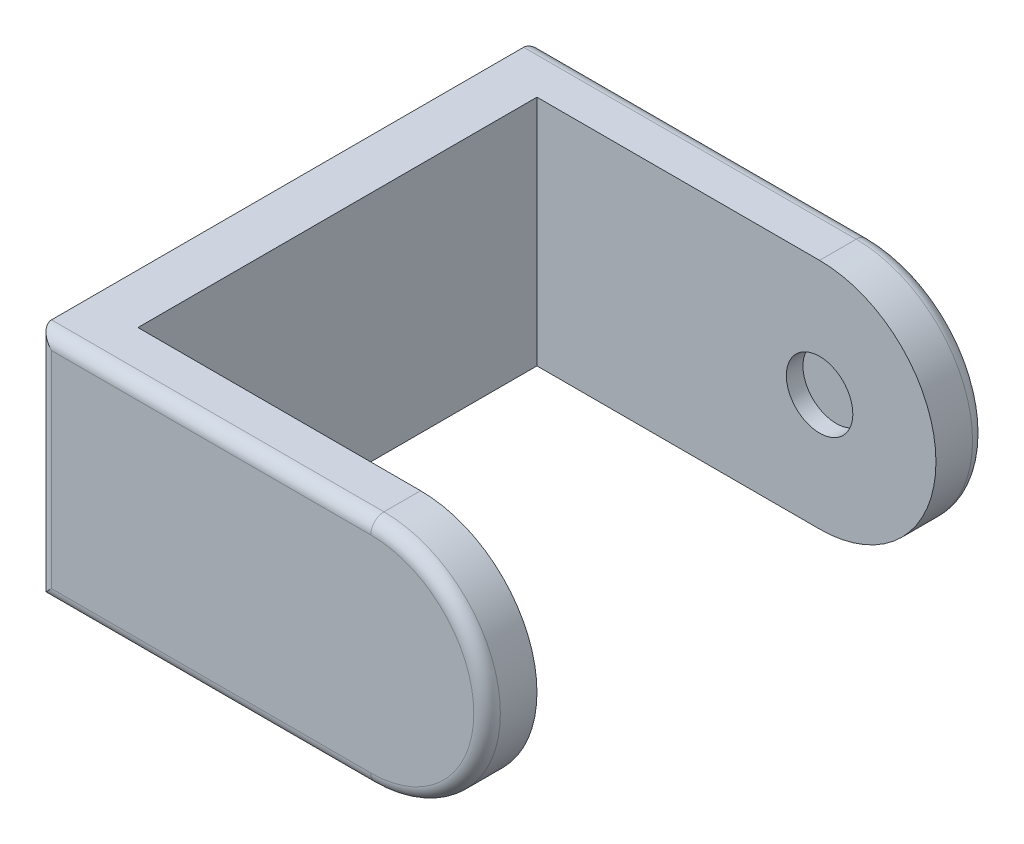
ISO-10303-21;
HEADER;
FILE_DESCRIPTION(('STEP AP214'),'2;1');
FILE_NAME('part.step','',(''),(''),'','','');
FILE_SCHEMA(('AUTOMOTIVE_DESIGN { 1 0 10303 214 1 1 1 1 }'));
ENDSEC;
DATA;
#1=APPLICATION_CONTEXT('core data for automotive mechanical design processes');
#2=APPLICATION_PROTOCOL_DEFINITION('international standard','automotive_design',2000,#1);
#3=PRODUCT_CONTEXT('',#1,'mechanical');
#4=PRODUCT('Part','Part','',(#3));
#5=PRODUCT_RELATED_PRODUCT_CATEGORY('part','',(#4));
#6=PRODUCT_DEFINITION_FORMATION('','',#4);
#7=PRODUCT_DEFINITION_CONTEXT('part definition',#1,'design');
#8=PRODUCT_DEFINITION('design','',#6,#7);
#9=PRODUCT_DEFINITION_SHAPE('','',#8);
#10=(LENGTH_UNIT() NAMED_UNIT(*) SI_UNIT(.MILLI.,.METRE.));
#11=(NAMED_UNIT(*) PLANE_ANGLE_UNIT() SI_UNIT($,.RADIAN.));
#12=(NAMED_UNIT(*) SI_UNIT($,.STERADIAN.) SOLID_ANGLE_UNIT());
#13=UNCERTAINTY_MEASURE_WITH_UNIT(LENGTH_MEASURE(1.E-05),#10,'distance_accuracy_value','');
#14=(GEOMETRIC_REPRESENTATION_CONTEXT(3) GLOBAL_UNCERTAINTY_ASSIGNED_CONTEXT((#13)) GLOBAL_UNIT_ASSIGNED_CONTEXT((#10,
#11,#12)) REPRESENTATION_CONTEXT('',''));
#15=CARTESIAN_POINT('',(0.,0.,0.));
#16=DIRECTION('',(0.,0.,1.));
#17=DIRECTION('',(1.,0.,0.));
#18=AXIS2_PLACEMENT_3D('',#15,#16,#17);
#19=CARTESIAN_POINT('',(15.,-35.,-75.));
#20=DIRECTION('',(0.,0.,1.));
#21=DIRECTION('',(1.,0.,0.));
#22=AXIS2_PLACEMENT_3D('',#19,#20,#21);
#23=PLANE('',#22);
#24=DIRECTION('',(0.,1.,0.));
#25=VECTOR('',#24,1.);
#26=CARTESIAN_POINT('',(4.,35.,-75.));
#27=LINE('',#26,#25);
#28=CARTESIAN_POINT('',(4.,-31.,-75.));
#29=VERTEX_POINT('',#28);
#30=CARTESIAN_POINT('',(4.,31.,-75.));
#31=VERTEX_POINT('',#30);
#32=EDGE_CURVE('E211',#29,#31,#27,.T.);
#33=ORIENTED_EDGE('',*,*,#32,.T.);
#34=DIRECTION('',(-1.,0.,0.));
#35=VECTOR('',#34,1.);
#36=CARTESIAN_POINT('',(15.,31.,-75.));
#37=LINE('',#36,#35);
#38=CARTESIAN_POINT('',(100.,31.0000000000001,-75.));
#39=VERTEX_POINT('',#38);
#40=EDGE_CURVE('E214',#31,#39,#37,.F.);
#41=ORIENTED_EDGE('',*,*,#40,.T.);
#42=CARTESIAN_POINT('',(100.,0.,-75.));
#43=DIRECTION('',(0.,0.,1.));
#44=DIRECTION('',(1.,0.,0.));
#45=AXIS2_PLACEMENT_3D('',#42,#43,#44);
#46=CIRCLE('',#45,31.0000000000001);
#47=CARTESIAN_POINT('',(100.,-31.0000000000001,-75.));
#48=VERTEX_POINT('',#47);
#49=EDGE_CURVE('E205',#39,#48,#46,.F.);
#50=ORIENTED_EDGE('',*,*,#49,.T.);
#51=DIRECTION('',(-1.,0.,0.));
#52=VECTOR('',#51,1.);
#53=CARTESIAN_POINT('',(15.,-31.,-75.));
#54=LINE('',#53,#52);
#55=EDGE_CURVE('E208',#48,#29,#54,.T.);
#56=ORIENTED_EDGE('',*,*,#55,.T.);
#57=EDGE_LOOP('',(#33,#41,#50,#56));
#58=FACE_BOUND('',#57,.T.);
#59=ADVANCED_FACE('F39',(#58),#23,.F.);
#60=CARTESIAN_POINT('',(15.,-35.,75.));
#61=DIRECTION('',(0.,0.,-1.));
#62=DIRECTION('',(-1.,0.,0.));
#63=AXIS2_PLACEMENT_3D('',#60,#61,#62);
#64=PLANE('',#63);
#65=DIRECTION('',(-1.,0.,0.));
#66=VECTOR('',#65,1.);
#67=CARTESIAN_POINT('',(15.,31.,75.));
#68=LINE('',#67,#66);
#69=CARTESIAN_POINT('',(100.,31.0000000000001,75.));
#70=VERTEX_POINT('',#69);
#71=CARTESIAN_POINT('',(4.,31.,75.));
#72=VERTEX_POINT('',#71);
#73=EDGE_CURVE('E57',#70,#72,#68,.T.);
#74=ORIENTED_EDGE('',*,*,#73,.T.);
#75=DIRECTION('',(0.,-1.,0.));
#76=VECTOR('',#75,1.);
#77=CARTESIAN_POINT('',(4.,-35.,75.));
#78=LINE('',#77,#76);
#79=CARTESIAN_POINT('',(4.,-31.,75.));
#80=VERTEX_POINT('',#79);
#81=EDGE_CURVE('E49',#72,#80,#78,.T.);
#82=ORIENTED_EDGE('',*,*,#81,.T.);
#83=DIRECTION('',(-1.,0.,0.));
#84=VECTOR('',#83,1.);
#85=CARTESIAN_POINT('',(15.,-31.,75.));
#86=LINE('',#85,#84);
#87=CARTESIAN_POINT('',(100.,-31.,75.));
#88=VERTEX_POINT('',#87);
#89=EDGE_CURVE('E233',#80,#88,#86,.F.);
#90=ORIENTED_EDGE('',*,*,#89,.T.);
#91=CARTESIAN_POINT('',(100.,0.,75.));
#92=DIRECTION('',(0.,0.,-1.));
#93=DIRECTION('',(-1.,0.,0.));
#94=AXIS2_PLACEMENT_3D('',#91,#92,#93);
#95=CIRCLE('',#94,31.0000000000001);
#96=EDGE_CURVE('E62',#88,#70,#95,.F.);
#97=ORIENTED_EDGE('',*,*,#96,.T.);
#98=EDGE_LOOP('',(#74,#82,#90,#97));
#99=FACE_BOUND('',#98,.T.);
#100=ADVANCED_FACE('F327',(#99),#64,.F.);
#101=CARTESIAN_POINT('',(135.,35.,60.));
#102=DIRECTION('',(0.,0.,1.));
#103=DIRECTION('',(0.,-1.,0.));
#104=AXIS2_PLACEMENT_3D('',#101,#102,#103);
#105=PLANE('',#104);
#106=CARTESIAN_POINT('',(100.,0.,60.));
#107=DIRECTION('',(0.,0.,1.));
#108=DIRECTION('',(0.,-1.,0.));
#109=AXIS2_PLACEMENT_3D('',#106,#107,#108);
#110=CIRCLE('',#109,9.99999999999999);
#111=CARTESIAN_POINT('',(100.,-10.,60.));
#112=VERTEX_POINT('',#111);
#113=EDGE_CURVE('E197',#112,#112,#110,.F.);
#114=ORIENTED_EDGE('',*,*,#113,.F.);
#115=EDGE_LOOP('',(#114));
#116=FACE_BOUND('',#115,.T.);
#117=CARTESIAN_POINT('',(100.,0.,60.));
#118=DIRECTION('',(0.,0.,1.));
#119=DIRECTION('',(0.,-1.,0.));
#120=AXIS2_PLACEMENT_3D('',#117,#118,#119);
#121=CIRCLE('',#120,35.0000000000001);
#122=CARTESIAN_POINT('',(100.,-35.,60.));
#123=VERTEX_POINT('',#122);
#124=CARTESIAN_POINT('',(100.,35.,60.));
#125=VERTEX_POINT('',#124);
#126=EDGE_CURVE('E153',#123,#125,#121,.T.);
#127=ORIENTED_EDGE('',*,*,#126,.F.);
#128=DIRECTION('',(-1.,0.,0.));
#129=VECTOR('',#128,1.);
#130=CARTESIAN_POINT('',(135.,-35.,60.));
#131=LINE('',#130,#129);
#132=CARTESIAN_POINT('',(15.,-35.,60.));
#133=VERTEX_POINT('',#132);
#134=EDGE_CURVE('E175',#123,#133,#131,.T.);
#135=ORIENTED_EDGE('',*,*,#134,.T.);
#136=DIRECTION('',(0.,1.,0.));
#137=VECTOR('',#136,1.);
#138=CARTESIAN_POINT('',(15.,35.,60.));
#139=LINE('',#138,#137);
#140=CARTESIAN_POINT('',(15.,35.,60.));
#141=VERTEX_POINT('',#140);
#142=EDGE_CURVE('E164',#133,#141,#139,.T.);
#143=ORIENTED_EDGE('',*,*,#142,.T.);
#144=DIRECTION('',(-1.,0.,0.));
#145=VECTOR('',#144,1.);
#146=CARTESIAN_POINT('',(135.,35.,60.));
#147=LINE('',#146,#145);
#148=EDGE_CURVE('E172',#125,#141,#147,.T.);
#149=ORIENTED_EDGE('',*,*,#148,.F.);
#150=EDGE_LOOP('',(#127,#135,#143,#149));
#151=FACE_BOUND('',#150,.T.);
#152=ADVANCED_FACE('F299',(#116,#151),#105,.F.);
#153=CARTESIAN_POINT('',(135.,35.,-60.));
#154=DIRECTION('',(0.,0.,-1.));
#155=DIRECTION('',(0.,1.,0.));
#156=AXIS2_PLACEMENT_3D('',#153,#154,#155);
#157=PLANE('',#156);
#158=CARTESIAN_POINT('',(100.,0.,-60.));
#159=DIRECTION('',(0.,0.,-1.));
#160=DIRECTION('',(0.,1.,0.));
#161=AXIS2_PLACEMENT_3D('',#158,#159,#160);
#162=CIRCLE('',#161,9.99999999999999);
#163=CARTESIAN_POINT('',(100.,10.,-60.));
#164=VERTEX_POINT('',#163);
#165=EDGE_CURVE('E193',#164,#164,#162,.F.);
#166=ORIENTED_EDGE('',*,*,#165,.F.);
#167=EDGE_LOOP('',(#166));
#168=FACE_BOUND('',#167,.T.);
#169=DIRECTION('',(-1.,0.,0.));
#170=VECTOR('',#169,1.);
#171=CARTESIAN_POINT('',(135.,-35.,-60.));
#172=LINE('',#171,#170);
#173=CARTESIAN_POINT('',(100.,-35.,-60.));
#174=VERTEX_POINT('',#173);
#175=CARTESIAN_POINT('',(15.,-35.,-60.));
#176=VERTEX_POINT('',#175);
#177=EDGE_CURVE('E135',#174,#176,#172,.T.);
#178=ORIENTED_EDGE('',*,*,#177,.F.);
#179=CARTESIAN_POINT('',(100.,0.,-60.));
#180=DIRECTION('',(0.,0.,-1.));
#181=DIRECTION('',(0.,1.,0.));
#182=AXIS2_PLACEMENT_3D('',#179,#180,#181);
#183=CIRCLE('',#182,35.0000000000001);
#184=CARTESIAN_POINT('',(100.,35.,-60.));
#185=VERTEX_POINT('',#184);
#186=EDGE_CURVE('E146',#185,#174,#183,.T.);
#187=ORIENTED_EDGE('',*,*,#186,.F.);
#188=DIRECTION('',(-1.,0.,0.));
#189=VECTOR('',#188,1.);
#190=CARTESIAN_POINT('',(135.,35.,-60.));
#191=LINE('',#190,#189);
#192=CARTESIAN_POINT('',(15.,35.,-60.));
#193=VERTEX_POINT('',#192);
#194=EDGE_CURVE('E160',#185,#193,#191,.T.);
#195=ORIENTED_EDGE('',*,*,#194,.T.);
#196=DIRECTION('',(0.,-1.,0.));
#197=VECTOR('',#196,1.);
#198=CARTESIAN_POINT('',(15.,35.,-60.));
#199=LINE('',#198,#197);
#200=EDGE_CURVE('E158',#193,#176,#199,.T.);
#201=ORIENTED_EDGE('',*,*,#200,.T.);
#202=EDGE_LOOP('',(#178,#187,#195,#201));
#203=FACE_BOUND('',#202,.T.);
#204=ADVANCED_FACE('F156',(#168,#203),#157,.F.);
#205=CARTESIAN_POINT('',(15.,35.,75.));
#206=DIRECTION('',(0.,-1.,0.));
#207=DIRECTION('',(0.,0.,-1.));
#208=AXIS2_PLACEMENT_3D('',#205,#206,#207);
#209=PLANE('',#208);
#210=DIRECTION('',(0.,0.,1.));
#211=VECTOR('',#210,1.);
#212=CARTESIAN_POINT('',(100.,35.,-75.));
#213=LINE('',#212,#211);
#214=CARTESIAN_POINT('',(100.,35.,-71.));
#215=VERTEX_POINT('',#214);
#216=EDGE_CURVE('E149',#215,#185,#213,.T.);
#217=ORIENTED_EDGE('',*,*,#216,.F.);
#218=DIRECTION('',(-1.,0.,0.));
#219=VECTOR('',#218,1.);
#220=CARTESIAN_POINT('',(15.,35.,-71.));
#221=LINE('',#220,#219);
#222=CARTESIAN_POINT('',(0.,35.,-71.));
#223=VERTEX_POINT('',#222);
#224=EDGE_CURVE('E201',#215,#223,#221,.T.);
#225=ORIENTED_EDGE('',*,*,#224,.T.);
#226=DIRECTION('',(0.,0.,1.));
#227=VECTOR('',#226,1.);
#228=CARTESIAN_POINT('',(0.,35.,75.));
#229=LINE('',#228,#227);
#230=CARTESIAN_POINT('',(0.,35.,71.));
#231=VERTEX_POINT('',#230);
#232=EDGE_CURVE('E178',#223,#231,#229,.T.);
#233=ORIENTED_EDGE('',*,*,#232,.T.);
#234=DIRECTION('',(-1.,0.,0.));
#235=VECTOR('',#234,1.);
#236=CARTESIAN_POINT('',(15.,35.,71.));
#237=LINE('',#236,#235);
#238=CARTESIAN_POINT('',(100.,35.,71.));
#239=VERTEX_POINT('',#238);
#240=EDGE_CURVE('E187',#231,#239,#237,.F.);
#241=ORIENTED_EDGE('',*,*,#240,.T.);
#242=EDGE_CURVE('E142',#125,#239,#213,.T.);
#243=ORIENTED_EDGE('',*,*,#242,.F.);
#244=ORIENTED_EDGE('',*,*,#148,.T.);
#245=DIRECTION('',(0.,0.,1.));
#246=VECTOR('',#245,1.);
#247=CARTESIAN_POINT('',(15.,35.,75.));
#248=LINE('',#247,#246);
#249=EDGE_CURVE('E179',#193,#141,#248,.T.);
#250=ORIENTED_EDGE('',*,*,#249,.F.);
#251=ORIENTED_EDGE('',*,*,#194,.F.);
#252=EDGE_LOOP('',(#217,#225,#233,#241,#243,#244,#250,#251));
#253=FACE_BOUND('',#252,.T.);
#254=ADVANCED_FACE('F296',(#253),#209,.F.);
#255=CARTESIAN_POINT('',(15.,0.,0.));
#256=DIRECTION('',(-1.,0.,0.));
#257=DIRECTION('',(0.,0.,1.));
#258=AXIS2_PLACEMENT_3D('',#255,#256,#257);
#259=PLANE('',#258);
#260=ORIENTED_EDGE('',*,*,#200,.F.);
#261=ORIENTED_EDGE('',*,*,#249,.T.);
#262=ORIENTED_EDGE('',*,*,#142,.F.);
#263=DIRECTION('',(0.,0.,-1.));
#264=VECTOR('',#263,1.);
#265=CARTESIAN_POINT('',(15.,-35.,75.));
#266=LINE('',#265,#264);
#267=EDGE_CURVE('E183',#133,#176,#266,.T.);
#268=ORIENTED_EDGE('',*,*,#267,.T.);
#269=EDGE_LOOP('',(#260,#261,#262,#268));
#270=FACE_BOUND('',#269,.T.);
#271=ADVANCED_FACE('F302',(#270),#259,.F.);
#272=CARTESIAN_POINT('',(15.,-35.,75.));
#273=DIRECTION('',(0.,1.,0.));
#274=DIRECTION('',(0.,0.,1.));
#275=AXIS2_PLACEMENT_3D('',#272,#273,#274);
#276=PLANE('',#275);
#277=DIRECTION('',(0.,0.,-1.));
#278=VECTOR('',#277,1.);
#279=CARTESIAN_POINT('',(0.,-35.,75.));
#280=LINE('',#279,#278);
#281=CARTESIAN_POINT('',(0.,-35.,71.));
#282=VERTEX_POINT('',#281);
#283=CARTESIAN_POINT('',(0.,-35.,-71.));
#284=VERTEX_POINT('',#283);
#285=EDGE_CURVE('E184',#282,#284,#280,.T.);
#286=ORIENTED_EDGE('',*,*,#285,.T.);
#287=DIRECTION('',(-1.,0.,0.));
#288=VECTOR('',#287,1.);
#289=CARTESIAN_POINT('',(15.,-35.,-71.));
#290=LINE('',#289,#288);
#291=CARTESIAN_POINT('',(100.,-35.,-71.));
#292=VERTEX_POINT('',#291);
#293=EDGE_CURVE('E138',#284,#292,#290,.F.);
#294=ORIENTED_EDGE('',*,*,#293,.T.);
#295=DIRECTION('',(0.,0.,1.));
#296=VECTOR('',#295,1.);
#297=CARTESIAN_POINT('',(100.,-35.,-75.));
#298=LINE('',#297,#296);
#299=EDGE_CURVE('E129',#292,#174,#298,.T.);
#300=ORIENTED_EDGE('',*,*,#299,.T.);
#301=ORIENTED_EDGE('',*,*,#177,.T.);
#302=ORIENTED_EDGE('',*,*,#267,.F.);
#303=ORIENTED_EDGE('',*,*,#134,.F.);
#304=CARTESIAN_POINT('',(100.,-35.,71.));
#305=VERTEX_POINT('',#304);
#306=EDGE_CURVE('E143',#123,#305,#298,.T.);
#307=ORIENTED_EDGE('',*,*,#306,.T.);
#308=DIRECTION('',(-1.,0.,0.));
#309=VECTOR('',#308,1.);
#310=CARTESIAN_POINT('',(15.,-35.,71.));
#311=LINE('',#310,#309);
#312=EDGE_CURVE('E225',#305,#282,#311,.T.);
#313=ORIENTED_EDGE('',*,*,#312,.T.);
#314=EDGE_LOOP('',(#286,#294,#300,#301,#302,#303,#307,#313));
#315=FACE_BOUND('',#314,.T.);
#316=ADVANCED_FACE('F132',(#315),#276,.F.);
#317=CARTESIAN_POINT('',(0.,0.,0.));
#318=DIRECTION('',(-1.,0.,0.));
#319=DIRECTION('',(0.,0.,1.));
#320=AXIS2_PLACEMENT_3D('',#317,#318,#319);
#321=PLANE('',#320);
#322=CARTESIAN_POINT('',(0.,0.,0.));
#323=DIRECTION('',(-1.,0.,0.));
#324=DIRECTION('',(0.,0.,1.));
#325=AXIS2_PLACEMENT_3D('',#322,#323,#324);
#326=CIRCLE('',#325,15.);
#327=CARTESIAN_POINT('',(0.,0.,15.));
#328=VERTEX_POINT('',#327);
#329=EDGE_CURVE('E534',#328,#328,#326,.T.);
#330=ORIENTED_EDGE('',*,*,#329,.F.);
#331=EDGE_LOOP('',(#330));
#332=FACE_BOUND('',#331,.T.);
#333=ORIENTED_EDGE('',*,*,#232,.F.);
#334=DIRECTION('',(0.,1.,0.));
#335=VECTOR('',#334,1.);
#336=CARTESIAN_POINT('',(0.,-35.,-71.));
#337=LINE('',#336,#335);
#338=EDGE_CURVE('E222',#223,#284,#337,.F.);
#339=ORIENTED_EDGE('',*,*,#338,.T.);
#340=ORIENTED_EDGE('',*,*,#285,.F.);
#341=DIRECTION('',(0.,-1.,0.));
#342=VECTOR('',#341,1.);
#343=CARTESIAN_POINT('',(0.,35.,71.));
#344=LINE('',#343,#342);
#345=EDGE_CURVE('E218',#282,#231,#344,.F.);
#346=ORIENTED_EDGE('',*,*,#345,.T.);
#347=EDGE_LOOP('',(#333,#339,#340,#346));
#348=FACE_BOUND('',#347,.T.);
#349=ADVANCED_FACE('F320',(#332,#348),#321,.T.);
#350=CARTESIAN_POINT('',(100.,0.,-75.));
#351=DIRECTION('',(0.,0.,1.));
#352=DIRECTION('',(1.,0.,0.));
#353=AXIS2_PLACEMENT_3D('',#350,#351,#352);
#354=CYLINDRICAL_SURFACE('',#353,35.0000000000001);
#355=ORIENTED_EDGE('',*,*,#299,.F.);
#356=CARTESIAN_POINT('',(100.,0.,-71.));
#357=DIRECTION('',(0.,0.,1.));
#358=DIRECTION('',(1.,0.,0.));
#359=AXIS2_PLACEMENT_3D('',#356,#357,#358);
#360=CIRCLE('',#359,35.0000000000001);
#361=EDGE_CURVE('E230',#292,#215,#360,.T.);
#362=ORIENTED_EDGE('',*,*,#361,.T.);
#363=ORIENTED_EDGE('',*,*,#216,.T.);
#364=ORIENTED_EDGE('',*,*,#186,.T.);
#365=EDGE_LOOP('',(#355,#362,#363,#364));
#366=FACE_BOUND('',#365,.T.);
#367=ADVANCED_FACE('F147',(#366),#354,.T.);
#368=ORIENTED_EDGE('',*,*,#242,.T.);
#369=CARTESIAN_POINT('',(100.,0.,71.));
#370=DIRECTION('',(0.,0.,-1.));
#371=DIRECTION('',(-1.,0.,0.));
#372=AXIS2_PLACEMENT_3D('',#369,#370,#371);
#373=CIRCLE('',#372,35.0000000000001);
#374=EDGE_CURVE('E11',#239,#305,#373,.T.);
#375=ORIENTED_EDGE('',*,*,#374,.T.);
#376=ORIENTED_EDGE('',*,*,#306,.F.);
#377=ORIENTED_EDGE('',*,*,#126,.T.);
#378=EDGE_LOOP('',(#368,#375,#376,#377));
#379=FACE_BOUND('',#378,.T.);
#380=ADVANCED_FACE('F281',(#379),#354,.T.);
#381=CARTESIAN_POINT('',(100.,0.,-65.));
#382=DIRECTION('',(0.,0.,-1.));
#383=DIRECTION('',(0.,1.,0.));
#384=AXIS2_PLACEMENT_3D('',#381,#382,#383);
#385=PLANE('',#384);
#386=CARTESIAN_POINT('',(100.,0.,-65.));
#387=DIRECTION('',(0.,0.,-1.));
#388=DIRECTION('',(0.,1.,0.));
#389=AXIS2_PLACEMENT_3D('',#386,#387,#388);
#390=CIRCLE('',#389,9.99999999999999);
#391=CARTESIAN_POINT('',(100.,10.,-65.));
#392=VERTEX_POINT('',#391);
#393=EDGE_CURVE('E198',#392,#392,#390,.T.);
#394=ORIENTED_EDGE('',*,*,#393,.F.);
#395=EDGE_LOOP('',(#394));
#396=FACE_BOUND('',#395,.T.);
#397=ADVANCED_FACE('F396',(#396),#385,.F.);
#398=CARTESIAN_POINT('',(100.,0.,-65.));
#399=DIRECTION('',(0.,0.,1.));
#400=DIRECTION('',(0.,-1.,0.));
#401=AXIS2_PLACEMENT_3D('',#398,#399,#400);
#402=CYLINDRICAL_SURFACE('',#401,9.99999999999999);
#403=ORIENTED_EDGE('',*,*,#393,.T.);
#404=EDGE_LOOP('',(#403));
#405=FACE_BOUND('',#404,.T.);
#406=ORIENTED_EDGE('',*,*,#165,.T.);
#407=EDGE_LOOP('',(#406));
#408=FACE_BOUND('',#407,.T.);
#409=ADVANCED_FACE('F388',(#405,#408),#402,.F.);
#410=CARTESIAN_POINT('',(100.,0.,65.));
#411=DIRECTION('',(0.,0.,-1.));
#412=DIRECTION('',(0.,1.,0.));
#413=AXIS2_PLACEMENT_3D('',#410,#411,#412);
#414=CIRCLE('',#413,9.99999999999999);
#415=CARTESIAN_POINT('',(100.,9.99999999999998,65.));
#416=VERTEX_POINT('',#415);
#417=EDGE_CURVE('E256',#416,#416,#414,.T.);
#418=ORIENTED_EDGE('',*,*,#417,.F.);
#419=EDGE_LOOP('',(#418));
#420=FACE_BOUND('',#419,.T.);
#421=ORIENTED_EDGE('',*,*,#113,.T.);
#422=EDGE_LOOP('',(#421));
#423=FACE_BOUND('',#422,.T.);
#424=ADVANCED_FACE('F380',(#420,#423),#402,.F.);
#425=CARTESIAN_POINT('',(100.,0.,65.));
#426=DIRECTION('',(0.,0.,-1.));
#427=DIRECTION('',(0.,1.,0.));
#428=AXIS2_PLACEMENT_3D('',#425,#426,#427);
#429=PLANE('',#428);
#430=ORIENTED_EDGE('',*,*,#417,.T.);
#431=EDGE_LOOP('',(#430));
#432=FACE_BOUND('',#431,.T.);
#433=ADVANCED_FACE('F343',(#432),#429,.T.);
#434=CARTESIAN_POINT('',(15.,-31.,-71.));
#435=DIRECTION('',(-1.,0.,0.));
#436=DIRECTION('',(0.,0.,1.));
#437=AXIS2_PLACEMENT_3D('',#434,#435,#436);
#438=CYLINDRICAL_SURFACE('',#437,4.);
#439=CARTESIAN_POINT('',(4.,-31.,-71.));
#440=DIRECTION('',(-0.707106781186547,0.707106781186547,0.));
#441=DIRECTION('',(-0.707106781186547,-0.707106781186547,0.));
#442=AXIS2_PLACEMENT_3D('',#439,#440,#441);
#443=ELLIPSE('',#442,5.65685424949238,4.);
#444=EDGE_CURVE('E248',#29,#284,#443,.T.);
#445=ORIENTED_EDGE('',*,*,#444,.F.);
#446=ORIENTED_EDGE('',*,*,#55,.F.);
#447=CARTESIAN_POINT('',(100.,-31.,-71.));
#448=DIRECTION('',(1.,0.,0.));
#449=DIRECTION('',(0.,0.,-1.));
#450=AXIS2_PLACEMENT_3D('',#447,#448,#449);
#451=CIRCLE('',#450,4.);
#452=EDGE_CURVE('E252',#292,#48,#451,.T.);
#453=ORIENTED_EDGE('',*,*,#452,.F.);
#454=ORIENTED_EDGE('',*,*,#293,.F.);
#455=EDGE_LOOP('',(#445,#446,#453,#454));
#456=FACE_BOUND('',#455,.T.);
#457=ADVANCED_FACE('F323',(#456),#438,.T.);
#458=CARTESIAN_POINT('',(100.,0.,-71.));
#459=DIRECTION('',(0.,0.,1.));
#460=DIRECTION('',(1.,0.,0.));
#461=AXIS2_PLACEMENT_3D('',#458,#459,#460);
#462=TOROIDAL_SURFACE('',#461,31.0000000000001,4.);
#463=ORIENTED_EDGE('',*,*,#452,.T.);
#464=ORIENTED_EDGE('',*,*,#49,.F.);
#465=CARTESIAN_POINT('',(100.,31.0000000000001,-71.));
#466=DIRECTION('',(-1.,0.,0.));
#467=DIRECTION('',(0.,0.,1.));
#468=AXIS2_PLACEMENT_3D('',#465,#466,#467);
#469=CIRCLE('',#468,4.);
#470=EDGE_CURVE('E245',#215,#39,#469,.T.);
#471=ORIENTED_EDGE('',*,*,#470,.F.);
#472=ORIENTED_EDGE('',*,*,#361,.F.);
#473=EDGE_LOOP('',(#463,#464,#471,#472));
#474=FACE_BOUND('',#473,.T.);
#475=ADVANCED_FACE('F309',(#474),#462,.T.);
#476=CARTESIAN_POINT('',(4.,-35.,-71.));
#477=DIRECTION('',(0.,-1.,0.));
#478=DIRECTION('',(0.,0.,-1.));
#479=AXIS2_PLACEMENT_3D('',#476,#477,#478);
#480=CYLINDRICAL_SURFACE('',#479,4.);
#481=ORIENTED_EDGE('',*,*,#444,.T.);
#482=ORIENTED_EDGE('',*,*,#338,.F.);
#483=CARTESIAN_POINT('',(4.,31.,-71.));
#484=DIRECTION('',(-0.707106781186547,-0.707106781186547,0.));
#485=DIRECTION('',(0.707106781186547,-0.707106781186547,0.));
#486=AXIS2_PLACEMENT_3D('',#483,#484,#485);
#487=ELLIPSE('',#486,5.65685424949238,4.);
#488=EDGE_CURVE('E242',#31,#223,#487,.F.);
#489=ORIENTED_EDGE('',*,*,#488,.F.);
#490=ORIENTED_EDGE('',*,*,#32,.F.);
#491=EDGE_LOOP('',(#481,#482,#489,#490));
#492=FACE_BOUND('',#491,.T.);
#493=ADVANCED_FACE('F317',(#492),#480,.T.);
#494=CARTESIAN_POINT('',(15.,31.,-71.));
#495=DIRECTION('',(-1.,0.,0.));
#496=DIRECTION('',(0.,0.,1.));
#497=AXIS2_PLACEMENT_3D('',#494,#495,#496);
#498=CYLINDRICAL_SURFACE('',#497,4.);
#499=ORIENTED_EDGE('',*,*,#470,.T.);
#500=ORIENTED_EDGE('',*,*,#40,.F.);
#501=ORIENTED_EDGE('',*,*,#488,.T.);
#502=ORIENTED_EDGE('',*,*,#224,.F.);
#503=EDGE_LOOP('',(#499,#500,#501,#502));
#504=FACE_BOUND('',#503,.T.);
#505=ADVANCED_FACE('F312',(#504),#498,.T.);
#506=CARTESIAN_POINT('',(100.,0.,71.));
#507=DIRECTION('',(0.,0.,-1.));
#508=DIRECTION('',(-1.,0.,0.));
#509=AXIS2_PLACEMENT_3D('',#506,#507,#508);
#510=TOROIDAL_SURFACE('',#509,31.0000000000001,4.);
#511=CARTESIAN_POINT('',(100.,-31.0000000000001,71.));
#512=DIRECTION('',(-1.,0.,0.));
#513=DIRECTION('',(0.,0.,1.));
#514=AXIS2_PLACEMENT_3D('',#511,#512,#513);
#515=CIRCLE('',#514,4.);
#516=EDGE_CURVE('E263',#305,#88,#515,.T.);
#517=ORIENTED_EDGE('',*,*,#516,.F.);
#518=ORIENTED_EDGE('',*,*,#374,.F.);
#519=CARTESIAN_POINT('',(100.,31.0000000000001,71.));
#520=DIRECTION('',(-1.,0.,0.));
#521=DIRECTION('',(0.,0.,1.));
#522=AXIS2_PLACEMENT_3D('',#519,#520,#521);
#523=CIRCLE('',#522,4.);
#524=EDGE_CURVE('E43',#70,#239,#523,.T.);
#525=ORIENTED_EDGE('',*,*,#524,.F.);
#526=ORIENTED_EDGE('',*,*,#96,.F.);
#527=EDGE_LOOP('',(#517,#518,#525,#526));
#528=FACE_BOUND('',#527,.T.);
#529=ADVANCED_FACE('F41',(#528),#510,.T.);
#530=CARTESIAN_POINT('',(15.,31.,71.));
#531=DIRECTION('',(-1.,0.,0.));
#532=DIRECTION('',(0.,0.,1.));
#533=AXIS2_PLACEMENT_3D('',#530,#531,#532);
#534=CYLINDRICAL_SURFACE('',#533,4.);
#535=ORIENTED_EDGE('',*,*,#524,.T.);
#536=ORIENTED_EDGE('',*,*,#240,.F.);
#537=CARTESIAN_POINT('',(4.,31.,71.));
#538=DIRECTION('',(-0.707106781186547,-0.707106781186547,0.));
#539=DIRECTION('',(-0.707106781186547,0.707106781186547,0.));
#540=AXIS2_PLACEMENT_3D('',#537,#538,#539);
#541=ELLIPSE('',#540,5.65685424949238,4.);
#542=EDGE_CURVE('E260',#72,#231,#541,.T.);
#543=ORIENTED_EDGE('',*,*,#542,.F.);
#544=ORIENTED_EDGE('',*,*,#73,.F.);
#545=EDGE_LOOP('',(#535,#536,#543,#544));
#546=FACE_BOUND('',#545,.T.);
#547=ADVANCED_FACE('F274',(#546),#534,.T.);
#548=CARTESIAN_POINT('',(15.,-31.,71.));
#549=DIRECTION('',(-1.,0.,0.));
#550=DIRECTION('',(0.,0.,1.));
#551=AXIS2_PLACEMENT_3D('',#548,#549,#550);
#552=CYLINDRICAL_SURFACE('',#551,4.);
#553=ORIENTED_EDGE('',*,*,#516,.T.);
#554=ORIENTED_EDGE('',*,*,#89,.F.);
#555=CARTESIAN_POINT('',(4.,-31.,71.));
#556=DIRECTION('',(-0.707106781186547,0.707106781186547,0.));
#557=DIRECTION('',(-0.707106781186547,-0.707106781186547,0.));
#558=AXIS2_PLACEMENT_3D('',#555,#556,#557);
#559=ELLIPSE('',#558,5.65685424949238,4.);
#560=EDGE_CURVE('E257',#282,#80,#559,.T.);
#561=ORIENTED_EDGE('',*,*,#560,.F.);
#562=ORIENTED_EDGE('',*,*,#312,.F.);
#563=EDGE_LOOP('',(#553,#554,#561,#562));
#564=FACE_BOUND('',#563,.T.);
#565=ADVANCED_FACE('F348',(#564),#552,.T.);
#566=CARTESIAN_POINT('',(4.,-35.,71.));
#567=DIRECTION('',(0.,1.,0.));
#568=DIRECTION('',(0.,0.,1.));
#569=AXIS2_PLACEMENT_3D('',#566,#567,#568);
#570=CYLINDRICAL_SURFACE('',#569,4.);
#571=ORIENTED_EDGE('',*,*,#542,.T.);
#572=ORIENTED_EDGE('',*,*,#345,.F.);
#573=ORIENTED_EDGE('',*,*,#560,.T.);
#574=ORIENTED_EDGE('',*,*,#81,.F.);
#575=EDGE_LOOP('',(#571,#572,#573,#574));
#576=FACE_BOUND('',#575,.T.);
#577=ADVANCED_FACE('F344',(#576),#570,.T.);
#578=CARTESIAN_POINT('',(5.,0.,0.));
#579=DIRECTION('',(-1.,0.,0.));
#580=DIRECTION('',(0.,0.,1.));
#581=AXIS2_PLACEMENT_3D('',#578,#579,#580);
#582=CYLINDRICAL_SURFACE('',#581,15.);
#583=CARTESIAN_POINT('',(5.,0.,0.));
#584=DIRECTION('',(-1.,0.,0.));
#585=DIRECTION('',(0.,0.,1.));
#586=AXIS2_PLACEMENT_3D('',#583,#584,#585);
#587=CIRCLE('',#586,15.);
#588=CARTESIAN_POINT('',(5.,0.,15.));
#589=VERTEX_POINT('',#588);
#590=EDGE_CURVE('E261',#589,#589,#587,.T.);
#591=ORIENTED_EDGE('',*,*,#590,.F.);
#592=EDGE_LOOP('',(#591));
#593=FACE_BOUND('',#592,.T.);
#594=ORIENTED_EDGE('',*,*,#329,.T.);
#595=EDGE_LOOP('',(#594));
#596=FACE_BOUND('',#595,.T.);
#597=ADVANCED_FACE('F347',(#593,#596),#582,.F.);
#598=CARTESIAN_POINT('',(5.,0.,0.));
#599=DIRECTION('',(-1.,0.,0.));
#600=DIRECTION('',(0.,0.,1.));
#601=AXIS2_PLACEMENT_3D('',#598,#599,#600);
#602=PLANE('',#601);
#603=ORIENTED_EDGE('',*,*,#590,.T.);
#604=EDGE_LOOP('',(#603));
#605=FACE_BOUND('',#604,.T.);
#606=ADVANCED_FACE('F516',(#605),#602,.T.);
#607=CLOSED_SHELL('',(#59,#100,#152,#204,#254,#271,#316,#349,#367,#380,#397,#409,#424,#433,#457,
#475,#493,#505,#529,#547,#565,#577,#597,#606));
#608=MANIFOLD_SOLID_BREP('B2',#607);
#609=ADVANCED_BREP_SHAPE_REPRESENTATION('',(#18,#608),#14);
#610=SHAPE_DEFINITION_REPRESENTATION(#9,#609);
ENDSEC;
END-ISO-10303-21;
